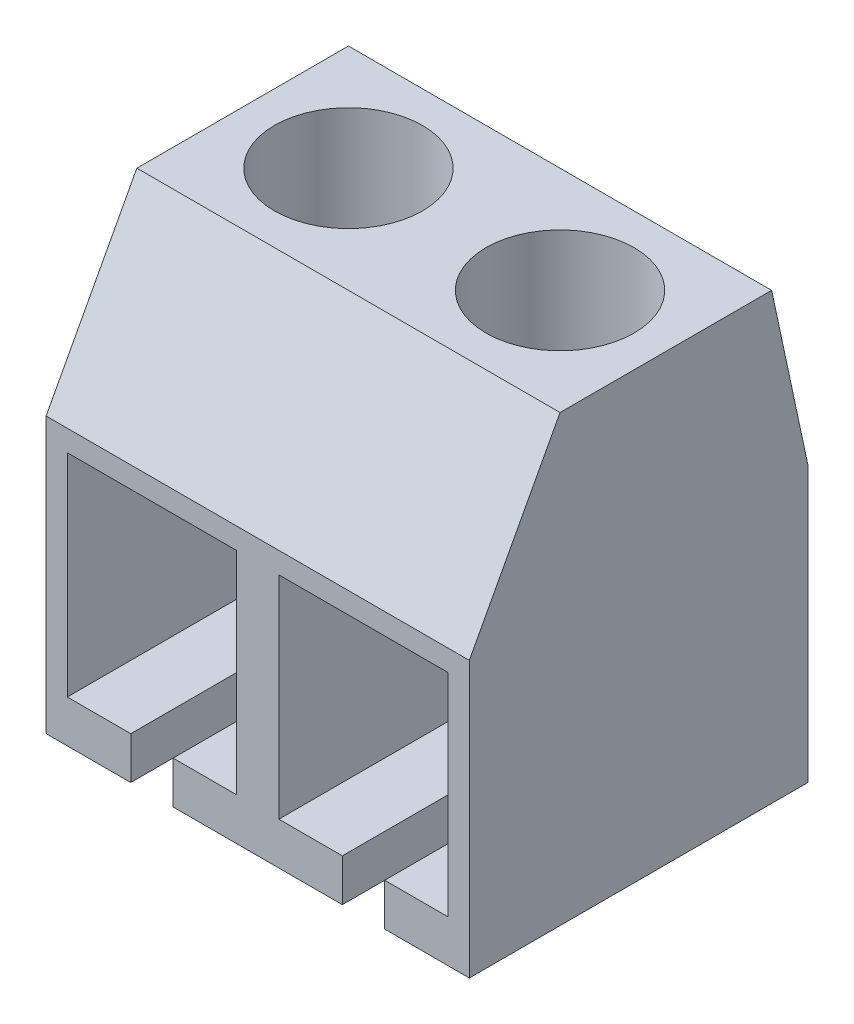
ISO-10303-21;
HEADER;
FILE_DESCRIPTION(('STEP AP214'),'2;1');
FILE_NAME('part.step','',(''),(''),'','','');
FILE_SCHEMA(('AUTOMOTIVE_DESIGN { 1 0 10303 214 1 1 1 1 }'));
ENDSEC;
DATA;
#1=APPLICATION_CONTEXT('core data for automotive mechanical design processes');
#2=APPLICATION_PROTOCOL_DEFINITION('international standard','automotive_design',2000,#1);
#3=PRODUCT_CONTEXT('',#1,'mechanical');
#4=PRODUCT('Part','Part','',(#3));
#5=PRODUCT_RELATED_PRODUCT_CATEGORY('part','',(#4));
#6=PRODUCT_DEFINITION_FORMATION('','',#4);
#7=PRODUCT_DEFINITION_CONTEXT('part definition',#1,'design');
#8=PRODUCT_DEFINITION('design','',#6,#7);
#9=PRODUCT_DEFINITION_SHAPE('','',#8);
#10=(LENGTH_UNIT() NAMED_UNIT(*) SI_UNIT(.MILLI.,.METRE.));
#11=(NAMED_UNIT(*) PLANE_ANGLE_UNIT() SI_UNIT($,.RADIAN.));
#12=(NAMED_UNIT(*) SI_UNIT($,.STERADIAN.) SOLID_ANGLE_UNIT());
#13=UNCERTAINTY_MEASURE_WITH_UNIT(LENGTH_MEASURE(1.E-05),#10,'distance_accuracy_value','');
#14=(GEOMETRIC_REPRESENTATION_CONTEXT(3) GLOBAL_UNCERTAINTY_ASSIGNED_CONTEXT((#13)) GLOBAL_UNIT_ASSIGNED_CONTEXT((#10,
#11,#12)) REPRESENTATION_CONTEXT('',''));
#15=CARTESIAN_POINT('',(0.,0.,0.));
#16=DIRECTION('',(0.,0.,1.));
#17=DIRECTION('',(1.,0.,0.));
#18=AXIS2_PLACEMENT_3D('',#15,#16,#17);
#19=CARTESIAN_POINT('',(-5.,-5.5,4.));
#20=DIRECTION('',(0.,-1.,0.));
#21=DIRECTION('',(0.,0.,-1.));
#22=AXIS2_PLACEMENT_3D('',#19,#20,#21);
#23=PLANE('',#22);
#24=DIRECTION('',(0.,0.,-1.));
#25=VECTOR('',#24,1.);
#26=CARTESIAN_POINT('',(2.,-5.49999999999999,6.));
#27=LINE('',#26,#25);
#28=CARTESIAN_POINT('',(2.,-5.49999999999999,4.));
#29=VERTEX_POINT('',#28);
#30=CARTESIAN_POINT('',(2.,-5.49999999999999,-4.));
#31=VERTEX_POINT('',#30);
#32=EDGE_CURVE('E227',#29,#31,#27,.T.);
#33=ORIENTED_EDGE('',*,*,#32,.F.);
#34=DIRECTION('',(1.,0.,0.));
#35=VECTOR('',#34,1.);
#36=CARTESIAN_POINT('',(-5.,-5.5,4.));
#37=LINE('',#36,#35);
#38=CARTESIAN_POINT('',(-2.,-5.5,4.));
#39=VERTEX_POINT('',#38);
#40=EDGE_CURVE('E312',#39,#29,#37,.T.);
#41=ORIENTED_EDGE('',*,*,#40,.F.);
#42=DIRECTION('',(0.,0.,-1.));
#43=VECTOR('',#42,1.);
#44=CARTESIAN_POINT('',(-2.,-5.49999999999999,6.));
#45=LINE('',#44,#43);
#46=CARTESIAN_POINT('',(-2.,-5.49999999999999,-4.));
#47=VERTEX_POINT('',#46);
#48=EDGE_CURVE('E57',#39,#47,#45,.T.);
#49=ORIENTED_EDGE('',*,*,#48,.T.);
#50=DIRECTION('',(1.,0.,0.));
#51=VECTOR('',#50,1.);
#52=CARTESIAN_POINT('',(-5.,-5.5,-4.));
#53=LINE('',#52,#51);
#54=EDGE_CURVE('E307',#47,#31,#53,.T.);
#55=ORIENTED_EDGE('',*,*,#54,.T.);
#56=EDGE_LOOP('',(#33,#41,#49,#55));
#57=FACE_BOUND('',#56,.T.);
#58=ADVANCED_FACE('F32',(#57),#23,.T.);
#59=DIRECTION('',(0.,0.,-1.));
#60=VECTOR('',#59,1.);
#61=CARTESIAN_POINT('',(-3.,-5.49999999999999,6.));
#62=LINE('',#61,#60);
#63=CARTESIAN_POINT('',(-3.,-5.49999999999999,4.));
#64=VERTEX_POINT('',#63);
#65=CARTESIAN_POINT('',(-3.,-5.49999999999999,-4.));
#66=VERTEX_POINT('',#65);
#67=EDGE_CURVE('E263',#64,#66,#62,.T.);
#68=ORIENTED_EDGE('',*,*,#67,.F.);
#69=CARTESIAN_POINT('',(-5.,-5.5,4.));
#70=VERTEX_POINT('',#69);
#71=EDGE_CURVE('E309',#70,#64,#37,.T.);
#72=ORIENTED_EDGE('',*,*,#71,.F.);
#73=DIRECTION('',(0.,0.,-1.));
#74=VECTOR('',#73,1.);
#75=CARTESIAN_POINT('',(-5.,-5.5,4.));
#76=LINE('',#75,#74);
#77=CARTESIAN_POINT('',(-5.,-5.5,-4.));
#78=VERTEX_POINT('',#77);
#79=EDGE_CURVE('E299',#70,#78,#76,.T.);
#80=ORIENTED_EDGE('',*,*,#79,.T.);
#81=EDGE_CURVE('E303',#78,#66,#53,.T.);
#82=ORIENTED_EDGE('',*,*,#81,.T.);
#83=EDGE_LOOP('',(#68,#72,#80,#82));
#84=FACE_BOUND('',#83,.T.);
#85=ADVANCED_FACE('F387',(#84),#23,.T.);
#86=CARTESIAN_POINT('',(-5.,1.,-4.));
#87=DIRECTION('',(0.,0.,-1.));
#88=DIRECTION('',(-1.,0.,0.));
#89=AXIS2_PLACEMENT_3D('',#86,#87,#88);
#90=PLANE('',#89);
#91=DIRECTION('',(0.,1.,0.));
#92=VECTOR('',#91,1.);
#93=CARTESIAN_POINT('',(2.,-4.5,-4.));
#94=LINE('',#93,#92);
#95=CARTESIAN_POINT('',(2.,-4.5,-4.));
#96=VERTEX_POINT('',#95);
#97=EDGE_CURVE('E206',#31,#96,#94,.T.);
#98=ORIENTED_EDGE('',*,*,#97,.F.);
#99=ORIENTED_EDGE('',*,*,#54,.F.);
#100=DIRECTION('',(0.,-1.,0.));
#101=VECTOR('',#100,1.);
#102=CARTESIAN_POINT('',(-2.,-4.5,-4.));
#103=LINE('',#102,#101);
#104=CARTESIAN_POINT('',(-2.,-4.5,-4.));
#105=VERTEX_POINT('',#104);
#106=EDGE_CURVE('E236',#105,#47,#103,.T.);
#107=ORIENTED_EDGE('',*,*,#106,.F.);
#108=DIRECTION('',(-1.,0.,0.));
#109=VECTOR('',#108,1.);
#110=CARTESIAN_POINT('',(-2.,-4.5,-4.));
#111=LINE('',#110,#109);
#112=CARTESIAN_POINT('',(-0.500000000000001,-4.5,-4.));
#113=VERTEX_POINT('',#112);
#114=EDGE_CURVE('E233',#113,#105,#111,.T.);
#115=ORIENTED_EDGE('',*,*,#114,.F.);
#116=DIRECTION('',(0.,-1.,0.));
#117=VECTOR('',#116,1.);
#118=CARTESIAN_POINT('',(-0.500000000000001,0.500000000000001,-4.));
#119=LINE('',#118,#117);
#120=CARTESIAN_POINT('',(-0.500000000000001,0.500000000000001,-4.));
#121=VERTEX_POINT('',#120);
#122=EDGE_CURVE('E250',#121,#113,#119,.T.);
#123=ORIENTED_EDGE('',*,*,#122,.F.);
#124=DIRECTION('',(1.,0.,0.));
#125=VECTOR('',#124,1.);
#126=CARTESIAN_POINT('',(-4.5,0.500000000000002,-4.));
#127=LINE('',#126,#125);
#128=CARTESIAN_POINT('',(-4.5,0.500000000000002,-4.));
#129=VERTEX_POINT('',#128);
#130=EDGE_CURVE('E247',#129,#121,#127,.T.);
#131=ORIENTED_EDGE('',*,*,#130,.F.);
#132=DIRECTION('',(0.,1.,0.));
#133=VECTOR('',#132,1.);
#134=CARTESIAN_POINT('',(-4.5,0.500000000000002,-4.));
#135=LINE('',#134,#133);
#136=CARTESIAN_POINT('',(-4.5,-4.5,-4.));
#137=VERTEX_POINT('',#136);
#138=EDGE_CURVE('E244',#137,#129,#135,.T.);
#139=ORIENTED_EDGE('',*,*,#138,.F.);
#140=DIRECTION('',(-1.,0.,0.));
#141=VECTOR('',#140,1.);
#142=CARTESIAN_POINT('',(-4.5,-4.5,-4.));
#143=LINE('',#142,#141);
#144=CARTESIAN_POINT('',(-3.,-4.5,-4.));
#145=VERTEX_POINT('',#144);
#146=EDGE_CURVE('E241',#145,#137,#143,.T.);
#147=ORIENTED_EDGE('',*,*,#146,.F.);
#148=DIRECTION('',(0.,1.,0.));
#149=VECTOR('',#148,1.);
#150=CARTESIAN_POINT('',(-3.,-4.5,-4.));
#151=LINE('',#150,#149);
#152=EDGE_CURVE('E238',#66,#145,#151,.T.);
#153=ORIENTED_EDGE('',*,*,#152,.F.);
#154=ORIENTED_EDGE('',*,*,#81,.F.);
#155=DIRECTION('',(0.,1.,0.));
#156=VECTOR('',#155,1.);
#157=CARTESIAN_POINT('',(-5.,1.,-4.));
#158=LINE('',#157,#156);
#159=CARTESIAN_POINT('',(-5.,1.,-4.));
#160=VERTEX_POINT('',#159);
#161=EDGE_CURVE('E284',#78,#160,#158,.T.);
#162=ORIENTED_EDGE('',*,*,#161,.T.);
#163=DIRECTION('',(1.,0.,0.));
#164=VECTOR('',#163,1.);
#165=CARTESIAN_POINT('',(-5.,1.,-4.));
#166=LINE('',#165,#164);
#167=CARTESIAN_POINT('',(5.,1.,-4.));
#168=VERTEX_POINT('',#167);
#169=EDGE_CURVE('E302',#160,#168,#166,.T.);
#170=ORIENTED_EDGE('',*,*,#169,.T.);
#171=DIRECTION('',(0.,1.,0.));
#172=VECTOR('',#171,1.);
#173=CARTESIAN_POINT('',(5.,1.,-4.));
#174=LINE('',#173,#172);
#175=CARTESIAN_POINT('',(5.,-5.5,-4.));
#176=VERTEX_POINT('',#175);
#177=EDGE_CURVE('E220',#176,#168,#174,.T.);
#178=ORIENTED_EDGE('',*,*,#177,.F.);
#179=CARTESIAN_POINT('',(3.,-5.49999999999999,-4.));
#180=VERTEX_POINT('',#179);
#181=EDGE_CURVE('E308',#180,#176,#53,.T.);
#182=ORIENTED_EDGE('',*,*,#181,.F.);
#183=DIRECTION('',(0.,-1.,0.));
#184=VECTOR('',#183,1.);
#185=CARTESIAN_POINT('',(3.,-4.5,-4.));
#186=LINE('',#185,#184);
#187=CARTESIAN_POINT('',(3.,-4.5,-4.));
#188=VERTEX_POINT('',#187);
#189=EDGE_CURVE('E204',#188,#180,#186,.T.);
#190=ORIENTED_EDGE('',*,*,#189,.F.);
#191=DIRECTION('',(-1.,0.,0.));
#192=VECTOR('',#191,1.);
#193=CARTESIAN_POINT('',(4.5,-4.5,-4.));
#194=LINE('',#193,#192);
#195=CARTESIAN_POINT('',(4.5,-4.5,-4.));
#196=VERTEX_POINT('',#195);
#197=EDGE_CURVE('E184',#196,#188,#194,.T.);
#198=ORIENTED_EDGE('',*,*,#197,.F.);
#199=DIRECTION('',(0.,-1.,0.));
#200=VECTOR('',#199,1.);
#201=CARTESIAN_POINT('',(4.5,0.500000000000001,-4.));
#202=LINE('',#201,#200);
#203=CARTESIAN_POINT('',(4.5,0.500000000000001,-4.));
#204=VERTEX_POINT('',#203);
#205=EDGE_CURVE('E193',#204,#196,#202,.T.);
#206=ORIENTED_EDGE('',*,*,#205,.F.);
#207=DIRECTION('',(1.,0.,0.));
#208=VECTOR('',#207,1.);
#209=CARTESIAN_POINT('',(4.5,0.500000000000001,-4.));
#210=LINE('',#209,#208);
#211=CARTESIAN_POINT('',(0.5,0.500000000000001,-4.));
#212=VERTEX_POINT('',#211);
#213=EDGE_CURVE('E190',#212,#204,#210,.T.);
#214=ORIENTED_EDGE('',*,*,#213,.F.);
#215=DIRECTION('',(0.,1.,0.));
#216=VECTOR('',#215,1.);
#217=CARTESIAN_POINT('',(0.5,0.500000000000001,-4.));
#218=LINE('',#217,#216);
#219=CARTESIAN_POINT('',(0.5,-4.5,-4.));
#220=VERTEX_POINT('',#219);
#221=EDGE_CURVE('E215',#220,#212,#218,.T.);
#222=ORIENTED_EDGE('',*,*,#221,.F.);
#223=DIRECTION('',(-1.,0.,0.));
#224=VECTOR('',#223,1.);
#225=CARTESIAN_POINT('',(2.,-4.5,-4.));
#226=LINE('',#225,#224);
#227=EDGE_CURVE('E212',#96,#220,#226,.T.);
#228=ORIENTED_EDGE('',*,*,#227,.F.);
#229=EDGE_LOOP('',(#98,#99,#107,#115,#123,#131,#139,#147,#153,#154,#162,#170,#178,#182,#190,
#198,#206,#214,#222,#228));
#230=FACE_BOUND('',#229,.T.);
#231=ADVANCED_FACE('F34',(#230),#90,.T.);
#232=DIRECTION('',(0.,0.,-1.));
#233=VECTOR('',#232,1.);
#234=CARTESIAN_POINT('',(3.,-5.49999999999999,6.));
#235=LINE('',#234,#233);
#236=CARTESIAN_POINT('',(3.,-5.49999999999999,4.));
#237=VERTEX_POINT('',#236);
#238=EDGE_CURVE('E229',#237,#180,#235,.T.);
#239=ORIENTED_EDGE('',*,*,#238,.T.);
#240=ORIENTED_EDGE('',*,*,#181,.T.);
#241=DIRECTION('',(0.,0.,-1.));
#242=VECTOR('',#241,1.);
#243=CARTESIAN_POINT('',(5.,-5.5,4.));
#244=LINE('',#243,#242);
#245=CARTESIAN_POINT('',(5.,-5.5,4.));
#246=VERTEX_POINT('',#245);
#247=EDGE_CURVE('E281',#246,#176,#244,.T.);
#248=ORIENTED_EDGE('',*,*,#247,.F.);
#249=EDGE_CURVE('E313',#237,#246,#37,.T.);
#250=ORIENTED_EDGE('',*,*,#249,.F.);
#251=EDGE_LOOP('',(#239,#240,#248,#250));
#252=FACE_BOUND('',#251,.T.);
#253=ADVANCED_FACE('F430',(#252),#23,.T.);
#254=CARTESIAN_POINT('',(-5.,1.,4.));
#255=DIRECTION('',(0.,0.,1.));
#256=DIRECTION('',(0.,-1.,0.));
#257=AXIS2_PLACEMENT_3D('',#254,#255,#256);
#258=PLANE('',#257);
#259=DIRECTION('',(0.,-1.,0.));
#260=VECTOR('',#259,1.);
#261=CARTESIAN_POINT('',(2.00000000000001,0.99999999999999,4.));
#262=LINE('',#261,#260);
#263=CARTESIAN_POINT('',(2.,-4.5,4.));
#264=VERTEX_POINT('',#263);
#265=EDGE_CURVE('E11',#264,#29,#262,.T.);
#266=ORIENTED_EDGE('',*,*,#265,.F.);
#267=DIRECTION('',(1.,0.,0.));
#268=VECTOR('',#267,1.);
#269=CARTESIAN_POINT('',(-5.,-4.5,4.));
#270=LINE('',#269,#268);
#271=CARTESIAN_POINT('',(0.5,-4.5,4.));
#272=VERTEX_POINT('',#271);
#273=EDGE_CURVE('E41',#272,#264,#270,.T.);
#274=ORIENTED_EDGE('',*,*,#273,.F.);
#275=DIRECTION('',(0.,-1.,0.));
#276=VECTOR('',#275,1.);
#277=CARTESIAN_POINT('',(0.5,1.,4.));
#278=LINE('',#277,#276);
#279=CARTESIAN_POINT('',(0.5,0.500000000000001,4.));
#280=VERTEX_POINT('',#279);
#281=EDGE_CURVE('E341',#280,#272,#278,.T.);
#282=ORIENTED_EDGE('',*,*,#281,.F.);
#283=DIRECTION('',(-1.,0.,0.));
#284=VECTOR('',#283,1.);
#285=CARTESIAN_POINT('',(-5.,0.500000000000001,4.));
#286=LINE('',#285,#284);
#287=CARTESIAN_POINT('',(4.5,0.500000000000001,4.));
#288=VERTEX_POINT('',#287);
#289=EDGE_CURVE('E339',#288,#280,#286,.T.);
#290=ORIENTED_EDGE('',*,*,#289,.F.);
#291=DIRECTION('',(0.,1.,0.));
#292=VECTOR('',#291,1.);
#293=CARTESIAN_POINT('',(4.5,1.,4.));
#294=LINE('',#293,#292);
#295=CARTESIAN_POINT('',(4.5,-4.5,4.));
#296=VERTEX_POINT('',#295);
#297=EDGE_CURVE('E337',#296,#288,#294,.T.);
#298=ORIENTED_EDGE('',*,*,#297,.F.);
#299=DIRECTION('',(1.,0.,0.));
#300=VECTOR('',#299,1.);
#301=CARTESIAN_POINT('',(-5.,-4.49999999999999,4.));
#302=LINE('',#301,#300);
#303=CARTESIAN_POINT('',(3.,-4.5,4.));
#304=VERTEX_POINT('',#303);
#305=EDGE_CURVE('E187',#304,#296,#302,.T.);
#306=ORIENTED_EDGE('',*,*,#305,.F.);
#307=DIRECTION('',(0.,1.,0.));
#308=VECTOR('',#307,1.);
#309=CARTESIAN_POINT('',(2.99999999999999,1.00000000000001,4.));
#310=LINE('',#309,#308);
#311=EDGE_CURVE('E335',#237,#304,#310,.T.);
#312=ORIENTED_EDGE('',*,*,#311,.F.);
#313=ORIENTED_EDGE('',*,*,#249,.T.);
#314=DIRECTION('',(0.,-1.,0.));
#315=VECTOR('',#314,1.);
#316=CARTESIAN_POINT('',(5.,1.,4.));
#317=LINE('',#316,#315);
#318=CARTESIAN_POINT('',(5.,1.,4.));
#319=VERTEX_POINT('',#318);
#320=EDGE_CURVE('E278',#319,#246,#317,.T.);
#321=ORIENTED_EDGE('',*,*,#320,.F.);
#322=DIRECTION('',(1.,0.,0.));
#323=VECTOR('',#322,1.);
#324=CARTESIAN_POINT('',(-5.,1.,4.));
#325=LINE('',#324,#323);
#326=CARTESIAN_POINT('',(-5.,1.,4.));
#327=VERTEX_POINT('',#326);
#328=EDGE_CURVE('E314',#327,#319,#325,.T.);
#329=ORIENTED_EDGE('',*,*,#328,.F.);
#330=DIRECTION('',(0.,-1.,0.));
#331=VECTOR('',#330,1.);
#332=CARTESIAN_POINT('',(-5.,1.,4.));
#333=LINE('',#332,#331);
#334=EDGE_CURVE('E296',#327,#70,#333,.T.);
#335=ORIENTED_EDGE('',*,*,#334,.T.);
#336=ORIENTED_EDGE('',*,*,#71,.T.);
#337=DIRECTION('',(0.,-1.,0.));
#338=VECTOR('',#337,1.);
#339=CARTESIAN_POINT('',(-3.,1.,4.));
#340=LINE('',#339,#338);
#341=CARTESIAN_POINT('',(-3.,-4.5,4.));
#342=VERTEX_POINT('',#341);
#343=EDGE_CURVE('E332',#342,#64,#340,.T.);
#344=ORIENTED_EDGE('',*,*,#343,.F.);
#345=DIRECTION('',(1.,0.,0.));
#346=VECTOR('',#345,1.);
#347=CARTESIAN_POINT('',(-5.,-4.5,4.));
#348=LINE('',#347,#346);
#349=CARTESIAN_POINT('',(-4.5,-4.5,4.));
#350=VERTEX_POINT('',#349);
#351=EDGE_CURVE('E330',#350,#342,#348,.T.);
#352=ORIENTED_EDGE('',*,*,#351,.F.);
#353=DIRECTION('',(0.,-1.,0.));
#354=VECTOR('',#353,1.);
#355=CARTESIAN_POINT('',(-4.5,1.,4.));
#356=LINE('',#355,#354);
#357=CARTESIAN_POINT('',(-4.5,0.500000000000002,4.));
#358=VERTEX_POINT('',#357);
#359=EDGE_CURVE('E328',#358,#350,#356,.T.);
#360=ORIENTED_EDGE('',*,*,#359,.F.);
#361=DIRECTION('',(-1.,0.,0.));
#362=VECTOR('',#361,1.);
#363=CARTESIAN_POINT('',(-5.,0.500000000000002,4.));
#364=LINE('',#363,#362);
#365=CARTESIAN_POINT('',(-0.500000000000001,0.500000000000001,4.));
#366=VERTEX_POINT('',#365);
#367=EDGE_CURVE('E326',#366,#358,#364,.T.);
#368=ORIENTED_EDGE('',*,*,#367,.F.);
#369=DIRECTION('',(0.,1.,0.));
#370=VECTOR('',#369,1.);
#371=CARTESIAN_POINT('',(-0.5,1.,4.));
#372=LINE('',#371,#370);
#373=CARTESIAN_POINT('',(-0.500000000000001,-4.5,4.));
#374=VERTEX_POINT('',#373);
#375=EDGE_CURVE('E324',#374,#366,#372,.T.);
#376=ORIENTED_EDGE('',*,*,#375,.F.);
#377=DIRECTION('',(1.,0.,0.));
#378=VECTOR('',#377,1.);
#379=CARTESIAN_POINT('',(-5.,-4.5,4.));
#380=LINE('',#379,#378);
#381=CARTESIAN_POINT('',(-2.,-4.5,4.));
#382=VERTEX_POINT('',#381);
#383=EDGE_CURVE('E322',#382,#374,#380,.T.);
#384=ORIENTED_EDGE('',*,*,#383,.F.);
#385=DIRECTION('',(0.,1.,0.));
#386=VECTOR('',#385,1.);
#387=CARTESIAN_POINT('',(-2.00000000000002,1.00000000000001,4.));
#388=LINE('',#387,#386);
#389=EDGE_CURVE('E306',#39,#382,#388,.T.);
#390=ORIENTED_EDGE('',*,*,#389,.F.);
#391=ORIENTED_EDGE('',*,*,#40,.T.);
#392=EDGE_LOOP('',(#266,#274,#282,#290,#298,#306,#312,#313,#321,#329,#335,#336,#344,#352,#360,
#368,#376,#384,#390,#391));
#393=FACE_BOUND('',#392,.T.);
#394=ADVANCED_FACE('F379',(#393),#258,.T.);
#395=CARTESIAN_POINT('',(-5.,1.,4.));
#396=DIRECTION('',(0.,0.472385008762964,0.881392309641975));
#397=DIRECTION('',(0.,-0.881392309641975,0.472385008762964));
#398=AXIS2_PLACEMENT_3D('',#395,#396,#397);
#399=PLANE('',#398);
#400=ORIENTED_EDGE('',*,*,#328,.T.);
#401=DIRECTION('',(0.,-0.881392309641975,0.472385008762964));
#402=VECTOR('',#401,1.);
#403=CARTESIAN_POINT('',(5.,1.,4.));
#404=LINE('',#403,#402);
#405=CARTESIAN_POINT('',(5.,5.,1.8561872909699));
#406=VERTEX_POINT('',#405);
#407=EDGE_CURVE('E275',#406,#319,#404,.T.);
#408=ORIENTED_EDGE('',*,*,#407,.F.);
#409=DIRECTION('',(1.,0.,0.));
#410=VECTOR('',#409,1.);
#411=CARTESIAN_POINT('',(-5.,5.,1.8561872909699));
#412=LINE('',#411,#410);
#413=CARTESIAN_POINT('',(-5.,5.,1.8561872909699));
#414=VERTEX_POINT('',#413);
#415=EDGE_CURVE('E316',#414,#406,#412,.T.);
#416=ORIENTED_EDGE('',*,*,#415,.F.);
#417=DIRECTION('',(0.,-0.881392309641975,0.472385008762964));
#418=VECTOR('',#417,1.);
#419=CARTESIAN_POINT('',(-5.,1.,4.));
#420=LINE('',#419,#418);
#421=EDGE_CURVE('E293',#414,#327,#420,.T.);
#422=ORIENTED_EDGE('',*,*,#421,.T.);
#423=EDGE_LOOP('',(#400,#408,#416,#422));
#424=FACE_BOUND('',#423,.T.);
#425=ADVANCED_FACE('F364',(#424),#399,.T.);
#426=CARTESIAN_POINT('',(-5.,5.,1.8561872909699));
#427=DIRECTION('',(0.,1.,0.));
#428=DIRECTION('',(0.,0.,1.));
#429=AXIS2_PLACEMENT_3D('',#426,#427,#428);
#430=PLANE('',#429);
#431=CARTESIAN_POINT('',(-2.5,5.,-0.643812709030097));
#432=DIRECTION('',(0.,1.,0.));
#433=DIRECTION('',(0.,0.,1.));
#434=AXIS2_PLACEMENT_3D('',#431,#432,#433);
#435=CIRCLE('',#434,1.75);
#436=CARTESIAN_POINT('',(-2.5,5.,1.1061872909699));
#437=VERTEX_POINT('',#436);
#438=EDGE_CURVE('E345',#437,#437,#435,.T.);
#439=ORIENTED_EDGE('',*,*,#438,.F.);
#440=EDGE_LOOP('',(#439));
#441=FACE_BOUND('',#440,.T.);
#442=CARTESIAN_POINT('',(2.5,5.,-0.643812709030097));
#443=DIRECTION('',(0.,1.,0.));
#444=DIRECTION('',(0.,0.,1.));
#445=AXIS2_PLACEMENT_3D('',#442,#443,#444);
#446=CIRCLE('',#445,1.75);
#447=CARTESIAN_POINT('',(2.5,5.,1.1061872909699));
#448=VERTEX_POINT('',#447);
#449=EDGE_CURVE('E350',#448,#448,#446,.T.);
#450=ORIENTED_EDGE('',*,*,#449,.F.);
#451=EDGE_LOOP('',(#450));
#452=FACE_BOUND('',#451,.T.);
#453=ORIENTED_EDGE('',*,*,#415,.T.);
#454=DIRECTION('',(0.,0.,1.));
#455=VECTOR('',#454,1.);
#456=CARTESIAN_POINT('',(5.,5.,1.8561872909699));
#457=LINE('',#456,#455);
#458=CARTESIAN_POINT('',(5.,5.,-3.1438127090301));
#459=VERTEX_POINT('',#458);
#460=EDGE_CURVE('E272',#459,#406,#457,.T.);
#461=ORIENTED_EDGE('',*,*,#460,.F.);
#462=DIRECTION('',(1.,0.,0.));
#463=VECTOR('',#462,1.);
#464=CARTESIAN_POINT('',(-5.,5.,-3.1438127090301));
#465=LINE('',#464,#463);
#466=CARTESIAN_POINT('',(-5.,5.,-3.1438127090301));
#467=VERTEX_POINT('',#466);
#468=EDGE_CURVE('E318',#467,#459,#465,.T.);
#469=ORIENTED_EDGE('',*,*,#468,.F.);
#470=DIRECTION('',(0.,0.,1.));
#471=VECTOR('',#470,1.);
#472=CARTESIAN_POINT('',(-5.,5.,1.8561872909699));
#473=LINE('',#472,#471);
#474=EDGE_CURVE('E290',#467,#414,#473,.T.);
#475=ORIENTED_EDGE('',*,*,#474,.T.);
#476=EDGE_LOOP('',(#453,#461,#469,#475));
#477=FACE_BOUND('',#476,.T.);
#478=ADVANCED_FACE('F360',(#441,#452,#477),#430,.T.);
#479=CARTESIAN_POINT('',(-5.,1.,-4.));
#480=DIRECTION('',(0.,0.209305738726685,-0.977850248113727));
#481=DIRECTION('',(0.,0.977850248113727,0.209305738726685));
#482=AXIS2_PLACEMENT_3D('',#479,#480,#481);
#483=PLANE('',#482);
#484=ORIENTED_EDGE('',*,*,#468,.T.);
#485=DIRECTION('',(0.,0.977850248113727,0.209305738726685));
#486=VECTOR('',#485,1.);
#487=CARTESIAN_POINT('',(5.,1.,-4.));
#488=LINE('',#487,#486);
#489=EDGE_CURVE('E269',#168,#459,#488,.T.);
#490=ORIENTED_EDGE('',*,*,#489,.F.);
#491=ORIENTED_EDGE('',*,*,#169,.F.);
#492=DIRECTION('',(0.,0.977850248113727,0.209305738726685));
#493=VECTOR('',#492,1.);
#494=CARTESIAN_POINT('',(-5.,1.,-4.));
#495=LINE('',#494,#493);
#496=EDGE_CURVE('E287',#160,#467,#495,.T.);
#497=ORIENTED_EDGE('',*,*,#496,.T.);
#498=EDGE_LOOP('',(#484,#490,#491,#497));
#499=FACE_BOUND('',#498,.T.);
#500=ADVANCED_FACE('F363',(#499),#483,.T.);
#501=CARTESIAN_POINT('',(-5.,0.,0.));
#502=DIRECTION('',(1.,0.,0.));
#503=DIRECTION('',(0.,0.,-1.));
#504=AXIS2_PLACEMENT_3D('',#501,#502,#503);
#505=PLANE('',#504);
#506=ORIENTED_EDGE('',*,*,#161,.F.);
#507=ORIENTED_EDGE('',*,*,#79,.F.);
#508=ORIENTED_EDGE('',*,*,#334,.F.);
#509=ORIENTED_EDGE('',*,*,#421,.F.);
#510=ORIENTED_EDGE('',*,*,#474,.F.);
#511=ORIENTED_EDGE('',*,*,#496,.F.);
#512=EDGE_LOOP('',(#506,#507,#508,#509,#510,#511));
#513=FACE_BOUND('',#512,.T.);
#514=ADVANCED_FACE('F383',(#513),#505,.F.);
#515=CARTESIAN_POINT('',(5.,0.,0.));
#516=DIRECTION('',(1.,0.,0.));
#517=DIRECTION('',(0.,0.,-1.));
#518=AXIS2_PLACEMENT_3D('',#515,#516,#517);
#519=PLANE('',#518);
#520=ORIENTED_EDGE('',*,*,#177,.T.);
#521=ORIENTED_EDGE('',*,*,#489,.T.);
#522=ORIENTED_EDGE('',*,*,#460,.T.);
#523=ORIENTED_EDGE('',*,*,#407,.T.);
#524=ORIENTED_EDGE('',*,*,#320,.T.);
#525=ORIENTED_EDGE('',*,*,#247,.T.);
#526=EDGE_LOOP('',(#520,#521,#522,#523,#524,#525));
#527=FACE_BOUND('',#526,.T.);
#528=ADVANCED_FACE('F373',(#527),#519,.T.);
#529=CARTESIAN_POINT('',(-2.,-4.5,6.));
#530=DIRECTION('',(0.,-1.,0.));
#531=DIRECTION('',(1.,0.,0.));
#532=AXIS2_PLACEMENT_3D('',#529,#530,#531);
#533=PLANE('',#532);
#534=ORIENTED_EDGE('',*,*,#383,.T.);
#535=DIRECTION('',(0.,0.,-1.));
#536=VECTOR('',#535,1.);
#537=CARTESIAN_POINT('',(-0.500000000000001,-4.5,6.));
#538=LINE('',#537,#536);
#539=EDGE_CURVE('E200',#374,#113,#538,.T.);
#540=ORIENTED_EDGE('',*,*,#539,.T.);
#541=ORIENTED_EDGE('',*,*,#114,.T.);
#542=DIRECTION('',(0.,0.,-1.));
#543=VECTOR('',#542,1.);
#544=CARTESIAN_POINT('',(-2.,-4.5,6.));
#545=LINE('',#544,#543);
#546=EDGE_CURVE('E253',#382,#105,#545,.T.);
#547=ORIENTED_EDGE('',*,*,#546,.F.);
#548=EDGE_LOOP('',(#534,#540,#541,#547));
#549=FACE_BOUND('',#548,.T.);
#550=ADVANCED_FACE('F416',(#549),#533,.F.);
#551=CARTESIAN_POINT('',(-0.500000000000001,0.500000000000001,6.));
#552=DIRECTION('',(1.,0.,0.));
#553=DIRECTION('',(0.,1.,0.));
#554=AXIS2_PLACEMENT_3D('',#551,#552,#553);
#555=PLANE('',#554);
#556=ORIENTED_EDGE('',*,*,#375,.T.);
#557=DIRECTION('',(0.,0.,-1.));
#558=VECTOR('',#557,1.);
#559=CARTESIAN_POINT('',(-0.500000000000001,0.500000000000001,6.));
#560=LINE('',#559,#558);
#561=EDGE_CURVE('E255',#366,#121,#560,.T.);
#562=ORIENTED_EDGE('',*,*,#561,.T.);
#563=ORIENTED_EDGE('',*,*,#122,.T.);
#564=ORIENTED_EDGE('',*,*,#539,.F.);
#565=EDGE_LOOP('',(#556,#562,#563,#564));
#566=FACE_BOUND('',#565,.T.);
#567=ADVANCED_FACE('F412',(#566),#555,.F.);
#568=CARTESIAN_POINT('',(-4.5,0.500000000000002,6.));
#569=DIRECTION('',(0.,1.,0.));
#570=DIRECTION('',(-1.,0.,0.));
#571=AXIS2_PLACEMENT_3D('',#568,#569,#570);
#572=PLANE('',#571);
#573=CARTESIAN_POINT('',(-2.5,0.500000000000001,-0.643812709030097));
#574=DIRECTION('',(0.,1.,0.));
#575=DIRECTION('',(-1.,0.,0.));
#576=AXIS2_PLACEMENT_3D('',#573,#574,#575);
#577=CIRCLE('',#576,1.75);
#578=CARTESIAN_POINT('',(-4.25,0.500000000000002,-0.643812709030097));
#579=VERTEX_POINT('',#578);
#580=EDGE_CURVE('E36',#579,#579,#577,.T.);
#581=ORIENTED_EDGE('',*,*,#580,.T.);
#582=EDGE_LOOP('',(#581));
#583=FACE_BOUND('',#582,.T.);
#584=ORIENTED_EDGE('',*,*,#367,.T.);
#585=DIRECTION('',(0.,0.,-1.));
#586=VECTOR('',#585,1.);
#587=CARTESIAN_POINT('',(-4.5,0.500000000000002,6.));
#588=LINE('',#587,#586);
#589=EDGE_CURVE('E257',#358,#129,#588,.T.);
#590=ORIENTED_EDGE('',*,*,#589,.T.);
#591=ORIENTED_EDGE('',*,*,#130,.T.);
#592=ORIENTED_EDGE('',*,*,#561,.F.);
#593=EDGE_LOOP('',(#584,#590,#591,#592));
#594=FACE_BOUND('',#593,.T.);
#595=ADVANCED_FACE('F409',(#583,#594),#572,.F.);
#596=CARTESIAN_POINT('',(-4.5,0.500000000000002,6.));
#597=DIRECTION('',(-1.,0.,0.));
#598=DIRECTION('',(0.,-1.,0.));
#599=AXIS2_PLACEMENT_3D('',#596,#597,#598);
#600=PLANE('',#599);
#601=ORIENTED_EDGE('',*,*,#359,.T.);
#602=DIRECTION('',(0.,0.,-1.));
#603=VECTOR('',#602,1.);
#604=CARTESIAN_POINT('',(-4.5,-4.5,6.));
#605=LINE('',#604,#603);
#606=EDGE_CURVE('E259',#350,#137,#605,.T.);
#607=ORIENTED_EDGE('',*,*,#606,.T.);
#608=ORIENTED_EDGE('',*,*,#138,.T.);
#609=ORIENTED_EDGE('',*,*,#589,.F.);
#610=EDGE_LOOP('',(#601,#607,#608,#609));
#611=FACE_BOUND('',#610,.T.);
#612=ADVANCED_FACE('F401',(#611),#600,.F.);
#613=CARTESIAN_POINT('',(-4.5,-4.5,6.));
#614=DIRECTION('',(0.,-1.,0.));
#615=DIRECTION('',(1.,0.,0.));
#616=AXIS2_PLACEMENT_3D('',#613,#614,#615);
#617=PLANE('',#616);
#618=ORIENTED_EDGE('',*,*,#351,.T.);
#619=DIRECTION('',(0.,0.,-1.));
#620=VECTOR('',#619,1.);
#621=CARTESIAN_POINT('',(-3.,-4.5,6.));
#622=LINE('',#621,#620);
#623=EDGE_CURVE('E261',#342,#145,#622,.T.);
#624=ORIENTED_EDGE('',*,*,#623,.T.);
#625=ORIENTED_EDGE('',*,*,#146,.T.);
#626=ORIENTED_EDGE('',*,*,#606,.F.);
#627=EDGE_LOOP('',(#618,#624,#625,#626));
#628=FACE_BOUND('',#627,.T.);
#629=ADVANCED_FACE('F397',(#628),#617,.F.);
#630=CARTESIAN_POINT('',(-3.,-4.5,6.));
#631=DIRECTION('',(-1.,0.,0.));
#632=DIRECTION('',(0.,-1.,0.));
#633=AXIS2_PLACEMENT_3D('',#630,#631,#632);
#634=PLANE('',#633);
#635=ORIENTED_EDGE('',*,*,#343,.T.);
#636=ORIENTED_EDGE('',*,*,#67,.T.);
#637=ORIENTED_EDGE('',*,*,#152,.T.);
#638=ORIENTED_EDGE('',*,*,#623,.F.);
#639=EDGE_LOOP('',(#635,#636,#637,#638));
#640=FACE_BOUND('',#639,.T.);
#641=ADVANCED_FACE('F393',(#640),#634,.F.);
#642=CARTESIAN_POINT('',(-2.,-4.5,6.));
#643=DIRECTION('',(1.,0.,0.));
#644=DIRECTION('',(0.,1.,0.));
#645=AXIS2_PLACEMENT_3D('',#642,#643,#644);
#646=PLANE('',#645);
#647=ORIENTED_EDGE('',*,*,#389,.T.);
#648=ORIENTED_EDGE('',*,*,#546,.T.);
#649=ORIENTED_EDGE('',*,*,#106,.T.);
#650=ORIENTED_EDGE('',*,*,#48,.F.);
#651=EDGE_LOOP('',(#647,#648,#649,#650));
#652=FACE_BOUND('',#651,.T.);
#653=ADVANCED_FACE('F454',(#652),#646,.F.);
#654=CARTESIAN_POINT('',(4.5,0.500000000000001,6.));
#655=DIRECTION('',(1.,0.,0.));
#656=DIRECTION('',(0.,1.,0.));
#657=AXIS2_PLACEMENT_3D('',#654,#655,#656);
#658=PLANE('',#657);
#659=ORIENTED_EDGE('',*,*,#297,.T.);
#660=DIRECTION('',(0.,0.,-1.));
#661=VECTOR('',#660,1.);
#662=CARTESIAN_POINT('',(4.5,0.500000000000001,6.));
#663=LINE('',#662,#661);
#664=EDGE_CURVE('E196',#288,#204,#663,.T.);
#665=ORIENTED_EDGE('',*,*,#664,.T.);
#666=ORIENTED_EDGE('',*,*,#205,.T.);
#667=DIRECTION('',(0.,0.,-1.));
#668=VECTOR('',#667,1.);
#669=CARTESIAN_POINT('',(4.5,-4.5,6.));
#670=LINE('',#669,#668);
#671=EDGE_CURVE('E180',#296,#196,#670,.T.);
#672=ORIENTED_EDGE('',*,*,#671,.F.);
#673=EDGE_LOOP('',(#659,#665,#666,#672));
#674=FACE_BOUND('',#673,.T.);
#675=ADVANCED_FACE('F194',(#674),#658,.F.);
#676=CARTESIAN_POINT('',(4.5,0.500000000000001,6.));
#677=DIRECTION('',(0.,1.,0.));
#678=DIRECTION('',(0.,0.,1.));
#679=AXIS2_PLACEMENT_3D('',#676,#677,#678);
#680=PLANE('',#679);
#681=CARTESIAN_POINT('',(2.5,0.500000000000001,-0.643812709030097));
#682=DIRECTION('',(0.,1.,0.));
#683=DIRECTION('',(0.,0.,1.));
#684=AXIS2_PLACEMENT_3D('',#681,#682,#683);
#685=CIRCLE('',#684,1.75);
#686=CARTESIAN_POINT('',(2.5,0.500000000000001,1.1061872909699));
#687=VERTEX_POINT('',#686);
#688=EDGE_CURVE('E343',#687,#687,#685,.T.);
#689=ORIENTED_EDGE('',*,*,#688,.T.);
#690=EDGE_LOOP('',(#689));
#691=FACE_BOUND('',#690,.T.);
#692=ORIENTED_EDGE('',*,*,#289,.T.);
#693=DIRECTION('',(0.,0.,-1.));
#694=VECTOR('',#693,1.);
#695=CARTESIAN_POINT('',(0.5,0.500000000000001,6.));
#696=LINE('',#695,#694);
#697=EDGE_CURVE('E221',#280,#212,#696,.T.);
#698=ORIENTED_EDGE('',*,*,#697,.T.);
#699=ORIENTED_EDGE('',*,*,#213,.T.);
#700=ORIENTED_EDGE('',*,*,#664,.F.);
#701=EDGE_LOOP('',(#692,#698,#699,#700));
#702=FACE_BOUND('',#701,.T.);
#703=ADVANCED_FACE('F446',(#691,#702),#680,.F.);
#704=CARTESIAN_POINT('',(0.5,0.500000000000001,6.));
#705=DIRECTION('',(-1.,0.,0.));
#706=DIRECTION('',(0.,-1.,0.));
#707=AXIS2_PLACEMENT_3D('',#704,#705,#706);
#708=PLANE('',#707);
#709=ORIENTED_EDGE('',*,*,#281,.T.);
#710=DIRECTION('',(0.,0.,-1.));
#711=VECTOR('',#710,1.);
#712=CARTESIAN_POINT('',(0.5,-4.5,6.));
#713=LINE('',#712,#711);
#714=EDGE_CURVE('E223',#272,#220,#713,.T.);
#715=ORIENTED_EDGE('',*,*,#714,.T.);
#716=ORIENTED_EDGE('',*,*,#221,.T.);
#717=ORIENTED_EDGE('',*,*,#697,.F.);
#718=EDGE_LOOP('',(#709,#715,#716,#717));
#719=FACE_BOUND('',#718,.T.);
#720=ADVANCED_FACE('F443',(#719),#708,.F.);
#721=CARTESIAN_POINT('',(2.,-4.5,6.));
#722=DIRECTION('',(0.,-1.,0.));
#723=DIRECTION('',(1.,0.,0.));
#724=AXIS2_PLACEMENT_3D('',#721,#722,#723);
#725=PLANE('',#724);
#726=ORIENTED_EDGE('',*,*,#273,.T.);
#727=DIRECTION('',(0.,0.,-1.));
#728=VECTOR('',#727,1.);
#729=CARTESIAN_POINT('',(2.,-4.5,6.));
#730=LINE('',#729,#728);
#731=EDGE_CURVE('E225',#264,#96,#730,.T.);
#732=ORIENTED_EDGE('',*,*,#731,.T.);
#733=ORIENTED_EDGE('',*,*,#227,.T.);
#734=ORIENTED_EDGE('',*,*,#714,.F.);
#735=EDGE_LOOP('',(#726,#732,#733,#734));
#736=FACE_BOUND('',#735,.T.);
#737=ADVANCED_FACE('F441',(#736),#725,.F.);
#738=CARTESIAN_POINT('',(2.,-4.5,6.));
#739=DIRECTION('',(-1.,0.,0.));
#740=DIRECTION('',(0.,-1.,0.));
#741=AXIS2_PLACEMENT_3D('',#738,#739,#740);
#742=PLANE('',#741);
#743=ORIENTED_EDGE('',*,*,#265,.T.);
#744=ORIENTED_EDGE('',*,*,#32,.T.);
#745=ORIENTED_EDGE('',*,*,#97,.T.);
#746=ORIENTED_EDGE('',*,*,#731,.F.);
#747=EDGE_LOOP('',(#743,#744,#745,#746));
#748=FACE_BOUND('',#747,.T.);
#749=ADVANCED_FACE('F435',(#748),#742,.F.);
#750=CARTESIAN_POINT('',(3.,-4.5,6.));
#751=DIRECTION('',(1.,0.,0.));
#752=DIRECTION('',(0.,1.,0.));
#753=AXIS2_PLACEMENT_3D('',#750,#751,#752);
#754=PLANE('',#753);
#755=ORIENTED_EDGE('',*,*,#311,.T.);
#756=DIRECTION('',(0.,0.,-1.));
#757=VECTOR('',#756,1.);
#758=CARTESIAN_POINT('',(3.,-4.5,6.));
#759=LINE('',#758,#757);
#760=EDGE_CURVE('E49',#304,#188,#759,.T.);
#761=ORIENTED_EDGE('',*,*,#760,.T.);
#762=ORIENTED_EDGE('',*,*,#189,.T.);
#763=ORIENTED_EDGE('',*,*,#238,.F.);
#764=EDGE_LOOP('',(#755,#761,#762,#763));
#765=FACE_BOUND('',#764,.T.);
#766=ADVANCED_FACE('F569',(#765),#754,.F.);
#767=CARTESIAN_POINT('',(4.5,-4.5,6.));
#768=DIRECTION('',(0.,-1.,0.));
#769=DIRECTION('',(1.,0.,0.));
#770=AXIS2_PLACEMENT_3D('',#767,#768,#769);
#771=PLANE('',#770);
#772=ORIENTED_EDGE('',*,*,#305,.T.);
#773=ORIENTED_EDGE('',*,*,#671,.T.);
#774=ORIENTED_EDGE('',*,*,#197,.T.);
#775=ORIENTED_EDGE('',*,*,#760,.F.);
#776=EDGE_LOOP('',(#772,#773,#774,#775));
#777=FACE_BOUND('',#776,.T.);
#778=ADVANCED_FACE('F182',(#777),#771,.F.);
#779=CARTESIAN_POINT('',(2.5,-2.,-0.643812709030097));
#780=DIRECTION('',(0.,1.,0.));
#781=DIRECTION('',(0.,0.,1.));
#782=AXIS2_PLACEMENT_3D('',#779,#780,#781);
#783=CYLINDRICAL_SURFACE('',#782,1.75);
#784=ORIENTED_EDGE('',*,*,#449,.T.);
#785=EDGE_LOOP('',(#784));
#786=FACE_BOUND('',#785,.T.);
#787=ORIENTED_EDGE('',*,*,#688,.F.);
#788=EDGE_LOOP('',(#787));
#789=FACE_BOUND('',#788,.T.);
#790=ADVANCED_FACE('F357',(#786,#789),#783,.F.);
#791=CARTESIAN_POINT('',(-2.5,-2.,-0.643812709030097));
#792=DIRECTION('',(0.,1.,0.));
#793=DIRECTION('',(0.,0.,1.));
#794=AXIS2_PLACEMENT_3D('',#791,#792,#793);
#795=CYLINDRICAL_SURFACE('',#794,1.75);
#796=ORIENTED_EDGE('',*,*,#438,.T.);
#797=EDGE_LOOP('',(#796));
#798=FACE_BOUND('',#797,.T.);
#799=ORIENTED_EDGE('',*,*,#580,.F.);
#800=EDGE_LOOP('',(#799));
#801=FACE_BOUND('',#800,.T.);
#802=ADVANCED_FACE('F554',(#798,#801),#795,.F.);
#803=CLOSED_SHELL('',(#58,#85,#231,#253,#394,#425,#478,#500,#514,#528,#550,#567,#595,#612,#629,
#641,#653,#675,#703,#720,#737,#749,#766,#778,#790,#802));
#804=MANIFOLD_SOLID_BREP('B2',#803);
#805=ADVANCED_BREP_SHAPE_REPRESENTATION('',(#18,#804),#14);
#806=SHAPE_DEFINITION_REPRESENTATION(#9,#805);
ENDSEC;
END-ISO-10303-21;
